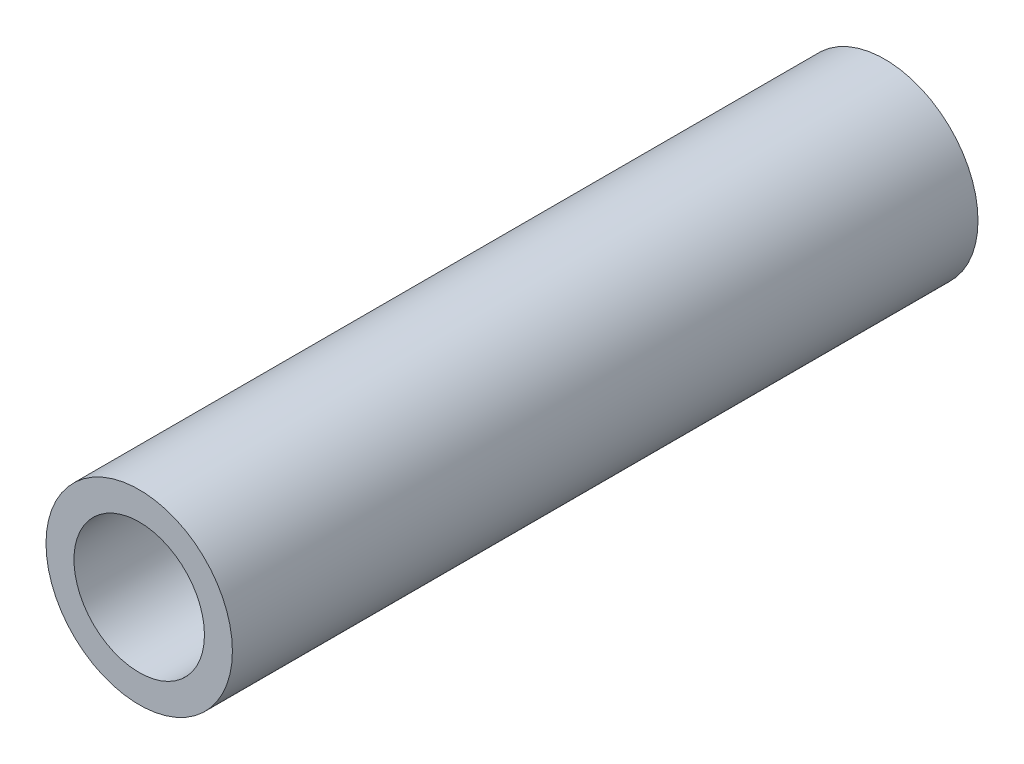
ISO-10303-21;
HEADER;
FILE_DESCRIPTION(('STEP AP214'),'2;1');
FILE_NAME('part.step','',(''),(''),'','','');
FILE_SCHEMA(('AUTOMOTIVE_DESIGN { 1 0 10303 214 1 1 1 1 }'));
ENDSEC;
DATA;
#1=APPLICATION_CONTEXT('core data for automotive mechanical design processes');
#2=APPLICATION_PROTOCOL_DEFINITION('international standard','automotive_design',2000,#1);
#3=PRODUCT_CONTEXT('',#1,'mechanical');
#4=PRODUCT('Part','Part','',(#3));
#5=PRODUCT_RELATED_PRODUCT_CATEGORY('part','',(#4));
#6=PRODUCT_DEFINITION_FORMATION('','',#4);
#7=PRODUCT_DEFINITION_CONTEXT('part definition',#1,'design');
#8=PRODUCT_DEFINITION('design','',#6,#7);
#9=PRODUCT_DEFINITION_SHAPE('','',#8);
#10=(LENGTH_UNIT() NAMED_UNIT(*) SI_UNIT(.MILLI.,.METRE.));
#11=(NAMED_UNIT(*) PLANE_ANGLE_UNIT() SI_UNIT($,.RADIAN.));
#12=(NAMED_UNIT(*) SI_UNIT($,.STERADIAN.) SOLID_ANGLE_UNIT());
#13=UNCERTAINTY_MEASURE_WITH_UNIT(LENGTH_MEASURE(1.E-05),#10,'distance_accuracy_value','');
#14=(GEOMETRIC_REPRESENTATION_CONTEXT(3) GLOBAL_UNCERTAINTY_ASSIGNED_CONTEXT((#13)) GLOBAL_UNIT_ASSIGNED_CONTEXT((#10,
#11,#12)) REPRESENTATION_CONTEXT('',''));
#15=CARTESIAN_POINT('',(0.,0.,0.));
#16=DIRECTION('',(0.,0.,1.));
#17=DIRECTION('',(1.,0.,0.));
#18=AXIS2_PLACEMENT_3D('',#15,#16,#17);
#19=CARTESIAN_POINT('',(0.,0.,12.));
#20=DIRECTION('',(0.,0.,1.));
#21=DIRECTION('',(1.,0.,0.));
#22=AXIS2_PLACEMENT_3D('',#19,#20,#21);
#23=PLANE('',#22);
#24=CARTESIAN_POINT('',(0.,0.,12.));
#25=DIRECTION('',(0.,0.,1.));
#26=DIRECTION('',(1.,0.,0.));
#27=AXIS2_PLACEMENT_3D('',#24,#25,#26);
#28=CIRCLE('',#27,1.5);
#29=CARTESIAN_POINT('',(1.5,0.,12.));
#30=VERTEX_POINT('',#29);
#31=EDGE_CURVE('E10',#30,#30,#28,.T.);
#32=ORIENTED_EDGE('',*,*,#31,.T.);
#33=EDGE_LOOP('',(#32));
#34=FACE_BOUND('',#33,.T.);
#35=CARTESIAN_POINT('',(0.,0.,12.));
#36=DIRECTION('',(0.,0.,1.));
#37=DIRECTION('',(1.,0.,0.));
#38=AXIS2_PLACEMENT_3D('',#35,#36,#37);
#39=CIRCLE('',#38,1.05);
#40=CARTESIAN_POINT('',(1.05,0.,12.));
#41=VERTEX_POINT('',#40);
#42=EDGE_CURVE('E40',#41,#41,#39,.T.);
#43=ORIENTED_EDGE('',*,*,#42,.F.);
#44=EDGE_LOOP('',(#43));
#45=FACE_BOUND('',#44,.T.);
#46=ADVANCED_FACE('F29',(#34,#45),#23,.T.);
#47=CARTESIAN_POINT('',(0.,0.,0.));
#48=DIRECTION('',(0.,0.,1.));
#49=DIRECTION('',(1.,0.,0.));
#50=AXIS2_PLACEMENT_3D('',#47,#48,#49);
#51=PLANE('',#50);
#52=CARTESIAN_POINT('',(0.,0.,0.));
#53=DIRECTION('',(0.,0.,1.));
#54=DIRECTION('',(1.,0.,0.));
#55=AXIS2_PLACEMENT_3D('',#52,#53,#54);
#56=CIRCLE('',#55,1.5);
#57=CARTESIAN_POINT('',(1.5,0.,0.));
#58=VERTEX_POINT('',#57);
#59=EDGE_CURVE('E36',#58,#58,#56,.T.);
#60=ORIENTED_EDGE('',*,*,#59,.F.);
#61=EDGE_LOOP('',(#60));
#62=FACE_BOUND('',#61,.T.);
#63=CARTESIAN_POINT('',(0.,0.,0.));
#64=DIRECTION('',(0.,0.,1.));
#65=DIRECTION('',(1.,0.,0.));
#66=AXIS2_PLACEMENT_3D('',#63,#64,#65);
#67=CIRCLE('',#66,1.05);
#68=CARTESIAN_POINT('',(1.05,0.,0.));
#69=VERTEX_POINT('',#68);
#70=EDGE_CURVE('E44',#69,#69,#67,.T.);
#71=ORIENTED_EDGE('',*,*,#70,.T.);
#72=EDGE_LOOP('',(#71));
#73=FACE_BOUND('',#72,.T.);
#74=ADVANCED_FACE('F50',(#62,#73),#51,.F.);
#75=CARTESIAN_POINT('',(0.,0.,12.));
#76=DIRECTION('',(0.,0.,-1.));
#77=DIRECTION('',(-1.,0.,0.));
#78=AXIS2_PLACEMENT_3D('',#75,#76,#77);
#79=CYLINDRICAL_SURFACE('',#78,1.5);
#80=ORIENTED_EDGE('',*,*,#31,.F.);
#81=EDGE_LOOP('',(#80));
#82=FACE_BOUND('',#81,.T.);
#83=ORIENTED_EDGE('',*,*,#59,.T.);
#84=EDGE_LOOP('',(#83));
#85=FACE_BOUND('',#84,.T.);
#86=ADVANCED_FACE('F31',(#82,#85),#79,.T.);
#87=CARTESIAN_POINT('',(0.,0.,12.));
#88=DIRECTION('',(0.,0.,-1.));
#89=DIRECTION('',(-1.,0.,0.));
#90=AXIS2_PLACEMENT_3D('',#87,#88,#89);
#91=CYLINDRICAL_SURFACE('',#90,1.05);
#92=ORIENTED_EDGE('',*,*,#42,.T.);
#93=EDGE_LOOP('',(#92));
#94=FACE_BOUND('',#93,.T.);
#95=ORIENTED_EDGE('',*,*,#70,.F.);
#96=EDGE_LOOP('',(#95));
#97=FACE_BOUND('',#96,.T.);
#98=ADVANCED_FACE('F52',(#94,#97),#91,.F.);
#99=CLOSED_SHELL('',(#46,#74,#86,#98));
#100=MANIFOLD_SOLID_BREP('B2',#99);
#101=ADVANCED_BREP_SHAPE_REPRESENTATION('',(#18,#100),#14);
#102=SHAPE_DEFINITION_REPRESENTATION(#9,#101);
ENDSEC;
END-ISO-10303-21;
